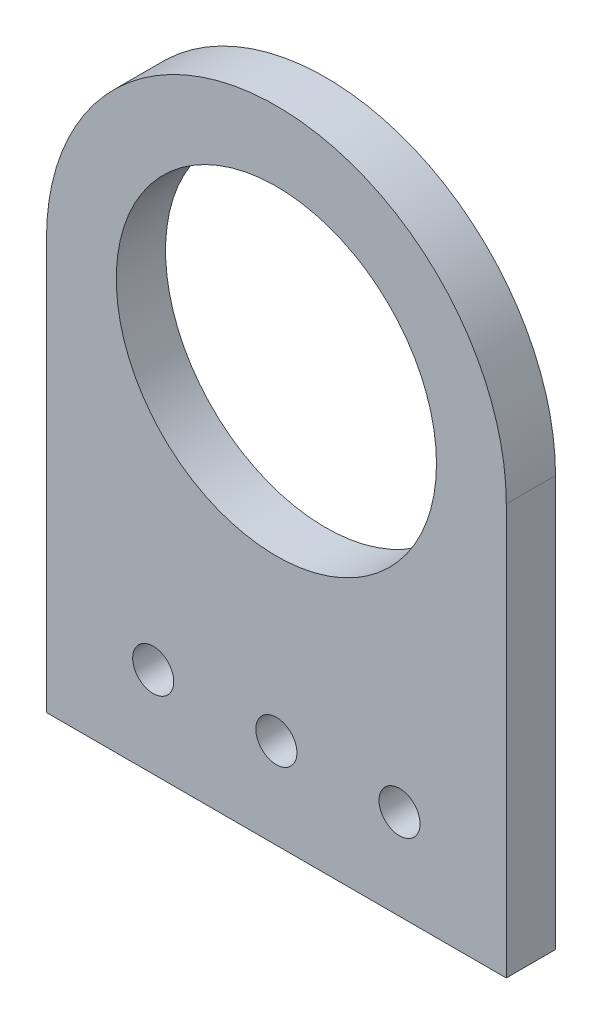
ISO-10303-21;
HEADER;
FILE_DESCRIPTION(('STEP AP214'),'2;1');
FILE_NAME('part.step','',(''),(''),'','','');
FILE_SCHEMA(('AUTOMOTIVE_DESIGN { 1 0 10303 214 1 1 1 1 }'));
ENDSEC;
DATA;
#1=APPLICATION_CONTEXT('core data for automotive mechanical design processes');
#2=APPLICATION_PROTOCOL_DEFINITION('international standard','automotive_design',2000,#1);
#3=PRODUCT_CONTEXT('',#1,'mechanical');
#4=PRODUCT('Part','Part','',(#3));
#5=PRODUCT_RELATED_PRODUCT_CATEGORY('part','',(#4));
#6=PRODUCT_DEFINITION_FORMATION('','',#4);
#7=PRODUCT_DEFINITION_CONTEXT('part definition',#1,'design');
#8=PRODUCT_DEFINITION('design','',#6,#7);
#9=PRODUCT_DEFINITION_SHAPE('','',#8);
#10=(LENGTH_UNIT() NAMED_UNIT(*) SI_UNIT(.MILLI.,.METRE.));
#11=(NAMED_UNIT(*) PLANE_ANGLE_UNIT() SI_UNIT($,.RADIAN.));
#12=(NAMED_UNIT(*) SI_UNIT($,.STERADIAN.) SOLID_ANGLE_UNIT());
#13=UNCERTAINTY_MEASURE_WITH_UNIT(LENGTH_MEASURE(1.E-05),#10,'distance_accuracy_value','');
#14=(GEOMETRIC_REPRESENTATION_CONTEXT(3) GLOBAL_UNCERTAINTY_ASSIGNED_CONTEXT((#13)) GLOBAL_UNIT_ASSIGNED_CONTEXT((#10,
#11,#12)) REPRESENTATION_CONTEXT('',''));
#15=CARTESIAN_POINT('',(0.,0.,0.));
#16=DIRECTION('',(0.,0.,1.));
#17=DIRECTION('',(1.,0.,0.));
#18=AXIS2_PLACEMENT_3D('',#15,#16,#17);
#19=CARTESIAN_POINT('',(0.,0.,3.));
#20=DIRECTION('',(0.,0.,-1.));
#21=DIRECTION('',(-1.,0.,0.));
#22=AXIS2_PLACEMENT_3D('',#19,#20,#21);
#23=PLANE('',#22);
#24=CARTESIAN_POINT('',(-7.5,-19.5000000000001,3.));
#25=DIRECTION('',(0.,0.,1.));
#26=DIRECTION('',(1.,0.,0.));
#27=AXIS2_PLACEMENT_3D('',#24,#25,#26);
#28=CIRCLE('',#27,1.25);
#29=CARTESIAN_POINT('',(-6.25,-19.5000000000001,3.));
#30=VERTEX_POINT('',#29);
#31=EDGE_CURVE('E124',#30,#30,#28,.T.);
#32=ORIENTED_EDGE('',*,*,#31,.F.);
#33=EDGE_LOOP('',(#32));
#34=FACE_BOUND('',#33,.T.);
#35=CARTESIAN_POINT('',(7.5,-19.5,3.));
#36=DIRECTION('',(0.,0.,1.));
#37=DIRECTION('',(1.,0.,0.));
#38=AXIS2_PLACEMENT_3D('',#35,#36,#37);
#39=CIRCLE('',#38,1.25);
#40=CARTESIAN_POINT('',(8.75,-19.5,3.));
#41=VERTEX_POINT('',#40);
#42=EDGE_CURVE('E130',#41,#41,#39,.T.);
#43=ORIENTED_EDGE('',*,*,#42,.F.);
#44=EDGE_LOOP('',(#43));
#45=FACE_BOUND('',#44,.T.);
#46=CARTESIAN_POINT('',(0.,-19.5,3.));
#47=DIRECTION('',(0.,0.,1.));
#48=DIRECTION('',(1.,0.,0.));
#49=AXIS2_PLACEMENT_3D('',#46,#47,#48);
#50=CIRCLE('',#49,1.25);
#51=CARTESIAN_POINT('',(1.25,-19.5,3.));
#52=VERTEX_POINT('',#51);
#53=EDGE_CURVE('E118',#52,#52,#50,.T.);
#54=ORIENTED_EDGE('',*,*,#53,.F.);
#55=EDGE_LOOP('',(#54));
#56=FACE_BOUND('',#55,.T.);
#57=CARTESIAN_POINT('',(0.,0.,3.));
#58=DIRECTION('',(0.,0.,1.));
#59=DIRECTION('',(-1.,0.,0.));
#60=AXIS2_PLACEMENT_3D('',#57,#58,#59);
#61=CIRCLE('',#60,14.);
#62=CARTESIAN_POINT('',(14.,0.,3.));
#63=VERTEX_POINT('',#62);
#64=CARTESIAN_POINT('',(-14.,0.,3.));
#65=VERTEX_POINT('',#64);
#66=EDGE_CURVE('E85',#63,#65,#61,.T.);
#67=ORIENTED_EDGE('',*,*,#66,.T.);
#68=DIRECTION('',(0.,-1.,0.));
#69=VECTOR('',#68,1.);
#70=CARTESIAN_POINT('',(-14.,-25.,3.));
#71=LINE('',#70,#69);
#72=CARTESIAN_POINT('',(-14.,-25.,3.));
#73=VERTEX_POINT('',#72);
#74=EDGE_CURVE('E80',#65,#73,#71,.T.);
#75=ORIENTED_EDGE('',*,*,#74,.T.);
#76=DIRECTION('',(1.,0.,0.));
#77=VECTOR('',#76,1.);
#78=CARTESIAN_POINT('',(-14.,-25.,3.));
#79=LINE('',#78,#77);
#80=CARTESIAN_POINT('',(14.,-25.,3.));
#81=VERTEX_POINT('',#80);
#82=EDGE_CURVE('E83',#73,#81,#79,.T.);
#83=ORIENTED_EDGE('',*,*,#82,.T.);
#84=DIRECTION('',(0.,1.,0.));
#85=VECTOR('',#84,1.);
#86=CARTESIAN_POINT('',(14.,-25.,3.));
#87=LINE('',#86,#85);
#88=EDGE_CURVE('E50',#81,#63,#87,.T.);
#89=ORIENTED_EDGE('',*,*,#88,.T.);
#90=EDGE_LOOP('',(#67,#75,#83,#89));
#91=FACE_BOUND('',#90,.T.);
#92=CARTESIAN_POINT('',(0.,0.,3.));
#93=DIRECTION('',(0.,0.,1.));
#94=DIRECTION('',(1.,0.,0.));
#95=AXIS2_PLACEMENT_3D('',#92,#93,#94);
#96=CIRCLE('',#95,9.75);
#97=CARTESIAN_POINT('',(9.75,0.,3.));
#98=VERTEX_POINT('',#97);
#99=EDGE_CURVE('E100',#98,#98,#96,.T.);
#100=ORIENTED_EDGE('',*,*,#99,.F.);
#101=EDGE_LOOP('',(#100));
#102=FACE_BOUND('',#101,.T.);
#103=ADVANCED_FACE('F33',(#34,#45,#56,#91,#102),#23,.F.);
#104=CARTESIAN_POINT('',(0.,0.,0.));
#105=DIRECTION('',(0.,0.,-1.));
#106=DIRECTION('',(-1.,0.,0.));
#107=AXIS2_PLACEMENT_3D('',#104,#105,#106);
#108=PLANE('',#107);
#109=CARTESIAN_POINT('',(-7.5,-19.5000000000001,0.));
#110=DIRECTION('',(0.,0.,1.));
#111=DIRECTION('',(1.,0.,0.));
#112=AXIS2_PLACEMENT_3D('',#109,#110,#111);
#113=CIRCLE('',#112,1.25);
#114=CARTESIAN_POINT('',(-6.25,-19.5000000000001,0.));
#115=VERTEX_POINT('',#114);
#116=EDGE_CURVE('E127',#115,#115,#113,.T.);
#117=ORIENTED_EDGE('',*,*,#116,.T.);
#118=EDGE_LOOP('',(#117));
#119=FACE_BOUND('',#118,.T.);
#120=CARTESIAN_POINT('',(7.5,-19.5,0.));
#121=DIRECTION('',(0.,0.,1.));
#122=DIRECTION('',(1.,0.,0.));
#123=AXIS2_PLACEMENT_3D('',#120,#121,#122);
#124=CIRCLE('',#123,1.25);
#125=CARTESIAN_POINT('',(8.75,-19.5,0.));
#126=VERTEX_POINT('',#125);
#127=EDGE_CURVE('E121',#126,#126,#124,.T.);
#128=ORIENTED_EDGE('',*,*,#127,.T.);
#129=EDGE_LOOP('',(#128));
#130=FACE_BOUND('',#129,.T.);
#131=CARTESIAN_POINT('',(0.,-19.5,0.));
#132=DIRECTION('',(0.,0.,1.));
#133=DIRECTION('',(1.,0.,0.));
#134=AXIS2_PLACEMENT_3D('',#131,#132,#133);
#135=CIRCLE('',#134,1.25);
#136=CARTESIAN_POINT('',(1.25,-19.5,0.));
#137=VERTEX_POINT('',#136);
#138=EDGE_CURVE('E115',#137,#137,#135,.T.);
#139=ORIENTED_EDGE('',*,*,#138,.T.);
#140=EDGE_LOOP('',(#139));
#141=FACE_BOUND('',#140,.T.);
#142=CARTESIAN_POINT('',(0.,0.,0.));
#143=DIRECTION('',(0.,0.,1.));
#144=DIRECTION('',(-1.,0.,0.));
#145=AXIS2_PLACEMENT_3D('',#142,#143,#144);
#146=CIRCLE('',#145,14.);
#147=CARTESIAN_POINT('',(14.,0.,0.));
#148=VERTEX_POINT('',#147);
#149=CARTESIAN_POINT('',(-14.,0.,0.));
#150=VERTEX_POINT('',#149);
#151=EDGE_CURVE('E97',#148,#150,#146,.T.);
#152=ORIENTED_EDGE('',*,*,#151,.F.);
#153=DIRECTION('',(0.,1.,0.));
#154=VECTOR('',#153,1.);
#155=CARTESIAN_POINT('',(14.,-25.,0.));
#156=LINE('',#155,#154);
#157=CARTESIAN_POINT('',(14.,-25.,0.));
#158=VERTEX_POINT('',#157);
#159=EDGE_CURVE('E73',#158,#148,#156,.T.);
#160=ORIENTED_EDGE('',*,*,#159,.F.);
#161=DIRECTION('',(1.,0.,0.));
#162=VECTOR('',#161,1.);
#163=CARTESIAN_POINT('',(-14.,-25.,0.));
#164=LINE('',#163,#162);
#165=CARTESIAN_POINT('',(-14.,-25.,0.));
#166=VERTEX_POINT('',#165);
#167=EDGE_CURVE('E67',#166,#158,#164,.T.);
#168=ORIENTED_EDGE('',*,*,#167,.F.);
#169=DIRECTION('',(0.,-1.,0.));
#170=VECTOR('',#169,1.);
#171=CARTESIAN_POINT('',(-14.,-25.,0.));
#172=LINE('',#171,#170);
#173=EDGE_CURVE('E89',#150,#166,#172,.T.);
#174=ORIENTED_EDGE('',*,*,#173,.F.);
#175=EDGE_LOOP('',(#152,#160,#168,#174));
#176=FACE_BOUND('',#175,.T.);
#177=CARTESIAN_POINT('',(0.,0.,0.));
#178=DIRECTION('',(0.,0.,1.));
#179=DIRECTION('',(1.,0.,0.));
#180=AXIS2_PLACEMENT_3D('',#177,#178,#179);
#181=CIRCLE('',#180,9.75);
#182=CARTESIAN_POINT('',(9.75,0.,0.));
#183=VERTEX_POINT('',#182);
#184=EDGE_CURVE('E112',#183,#183,#181,.T.);
#185=ORIENTED_EDGE('',*,*,#184,.T.);
#186=EDGE_LOOP('',(#185));
#187=FACE_BOUND('',#186,.T.);
#188=ADVANCED_FACE('F108',(#119,#130,#141,#176,#187),#108,.T.);
#189=CARTESIAN_POINT('',(0.,0.,3.));
#190=DIRECTION('',(0.,0.,-1.));
#191=DIRECTION('',(-1.,0.,0.));
#192=AXIS2_PLACEMENT_3D('',#189,#190,#191);
#193=CYLINDRICAL_SURFACE('',#192,14.);
#194=ORIENTED_EDGE('',*,*,#151,.T.);
#195=DIRECTION('',(0.,0.,-1.));
#196=VECTOR('',#195,1.);
#197=CARTESIAN_POINT('',(-14.,0.,3.));
#198=LINE('',#197,#196);
#199=EDGE_CURVE('E11',#65,#150,#198,.T.);
#200=ORIENTED_EDGE('',*,*,#199,.F.);
#201=ORIENTED_EDGE('',*,*,#66,.F.);
#202=DIRECTION('',(0.,0.,-1.));
#203=VECTOR('',#202,1.);
#204=CARTESIAN_POINT('',(14.,0.,3.));
#205=LINE('',#204,#203);
#206=EDGE_CURVE('E93',#63,#148,#205,.T.);
#207=ORIENTED_EDGE('',*,*,#206,.T.);
#208=EDGE_LOOP('',(#194,#200,#201,#207));
#209=FACE_BOUND('',#208,.T.);
#210=ADVANCED_FACE('F35',(#209),#193,.T.);
#211=CARTESIAN_POINT('',(-14.,-25.,3.));
#212=DIRECTION('',(1.,0.,0.));
#213=DIRECTION('',(0.,0.,-1.));
#214=AXIS2_PLACEMENT_3D('',#211,#212,#213);
#215=PLANE('',#214);
#216=ORIENTED_EDGE('',*,*,#173,.T.);
#217=DIRECTION('',(0.,0.,-1.));
#218=VECTOR('',#217,1.);
#219=CARTESIAN_POINT('',(-14.,-25.,3.));
#220=LINE('',#219,#218);
#221=EDGE_CURVE('E42',#73,#166,#220,.T.);
#222=ORIENTED_EDGE('',*,*,#221,.F.);
#223=ORIENTED_EDGE('',*,*,#74,.F.);
#224=ORIENTED_EDGE('',*,*,#199,.T.);
#225=EDGE_LOOP('',(#216,#222,#223,#224));
#226=FACE_BOUND('',#225,.T.);
#227=ADVANCED_FACE('F88',(#226),#215,.F.);
#228=CARTESIAN_POINT('',(-14.,-25.,3.));
#229=DIRECTION('',(0.,1.,0.));
#230=DIRECTION('',(0.,0.,1.));
#231=AXIS2_PLACEMENT_3D('',#228,#229,#230);
#232=PLANE('',#231);
#233=ORIENTED_EDGE('',*,*,#167,.T.);
#234=DIRECTION('',(0.,0.,-1.));
#235=VECTOR('',#234,1.);
#236=CARTESIAN_POINT('',(14.,-25.,3.));
#237=LINE('',#236,#235);
#238=EDGE_CURVE('E90',#81,#158,#237,.T.);
#239=ORIENTED_EDGE('',*,*,#238,.F.);
#240=ORIENTED_EDGE('',*,*,#82,.F.);
#241=ORIENTED_EDGE('',*,*,#221,.T.);
#242=EDGE_LOOP('',(#233,#239,#240,#241));
#243=FACE_BOUND('',#242,.T.);
#244=ADVANCED_FACE('F91',(#243),#232,.F.);
#245=CARTESIAN_POINT('',(14.,-25.,3.));
#246=DIRECTION('',(-1.,0.,0.));
#247=DIRECTION('',(0.,0.,1.));
#248=AXIS2_PLACEMENT_3D('',#245,#246,#247);
#249=PLANE('',#248);
#250=ORIENTED_EDGE('',*,*,#159,.T.);
#251=ORIENTED_EDGE('',*,*,#206,.F.);
#252=ORIENTED_EDGE('',*,*,#88,.F.);
#253=ORIENTED_EDGE('',*,*,#238,.T.);
#254=EDGE_LOOP('',(#250,#251,#252,#253));
#255=FACE_BOUND('',#254,.T.);
#256=ADVANCED_FACE('F105',(#255),#249,.F.);
#257=CARTESIAN_POINT('',(0.,0.,3.));
#258=DIRECTION('',(0.,0.,-1.));
#259=DIRECTION('',(-1.,0.,0.));
#260=AXIS2_PLACEMENT_3D('',#257,#258,#259);
#261=CYLINDRICAL_SURFACE('',#260,9.75);
#262=ORIENTED_EDGE('',*,*,#99,.T.);
#263=EDGE_LOOP('',(#262));
#264=FACE_BOUND('',#263,.T.);
#265=ORIENTED_EDGE('',*,*,#184,.F.);
#266=EDGE_LOOP('',(#265));
#267=FACE_BOUND('',#266,.T.);
#268=ADVANCED_FACE('F153',(#264,#267),#261,.F.);
#269=CARTESIAN_POINT('',(0.,-19.5,0.));
#270=DIRECTION('',(0.,0.,1.));
#271=DIRECTION('',(1.,0.,0.));
#272=AXIS2_PLACEMENT_3D('',#269,#270,#271);
#273=CYLINDRICAL_SURFACE('',#272,1.25);
#274=ORIENTED_EDGE('',*,*,#138,.F.);
#275=EDGE_LOOP('',(#274));
#276=FACE_BOUND('',#275,.T.);
#277=ORIENTED_EDGE('',*,*,#53,.T.);
#278=EDGE_LOOP('',(#277));
#279=FACE_BOUND('',#278,.T.);
#280=ADVANCED_FACE('F142',(#276,#279),#273,.F.);
#281=CARTESIAN_POINT('',(7.5,-19.5,0.));
#282=DIRECTION('',(0.,0.,1.));
#283=DIRECTION('',(1.,0.,0.));
#284=AXIS2_PLACEMENT_3D('',#281,#282,#283);
#285=CYLINDRICAL_SURFACE('',#284,1.25);
#286=ORIENTED_EDGE('',*,*,#127,.F.);
#287=EDGE_LOOP('',(#286));
#288=FACE_BOUND('',#287,.T.);
#289=ORIENTED_EDGE('',*,*,#42,.T.);
#290=EDGE_LOOP('',(#289));
#291=FACE_BOUND('',#290,.T.);
#292=ADVANCED_FACE('F138',(#288,#291),#285,.F.);
#293=CARTESIAN_POINT('',(-7.5,-19.5000000000001,0.));
#294=DIRECTION('',(0.,0.,1.));
#295=DIRECTION('',(1.,0.,0.));
#296=AXIS2_PLACEMENT_3D('',#293,#294,#295);
#297=CYLINDRICAL_SURFACE('',#296,1.25);
#298=ORIENTED_EDGE('',*,*,#116,.F.);
#299=EDGE_LOOP('',(#298));
#300=FACE_BOUND('',#299,.T.);
#301=ORIENTED_EDGE('',*,*,#31,.T.);
#302=EDGE_LOOP('',(#301));
#303=FACE_BOUND('',#302,.T.);
#304=ADVANCED_FACE('F141',(#300,#303),#297,.F.);
#305=CLOSED_SHELL('',(#103,#188,#210,#227,#244,#256,#268,#280,#292,#304));
#306=MANIFOLD_SOLID_BREP('B2',#305);
#307=ADVANCED_BREP_SHAPE_REPRESENTATION('',(#18,#306),#14);
#308=SHAPE_DEFINITION_REPRESENTATION(#9,#307);
ENDSEC;
END-ISO-10303-21;
